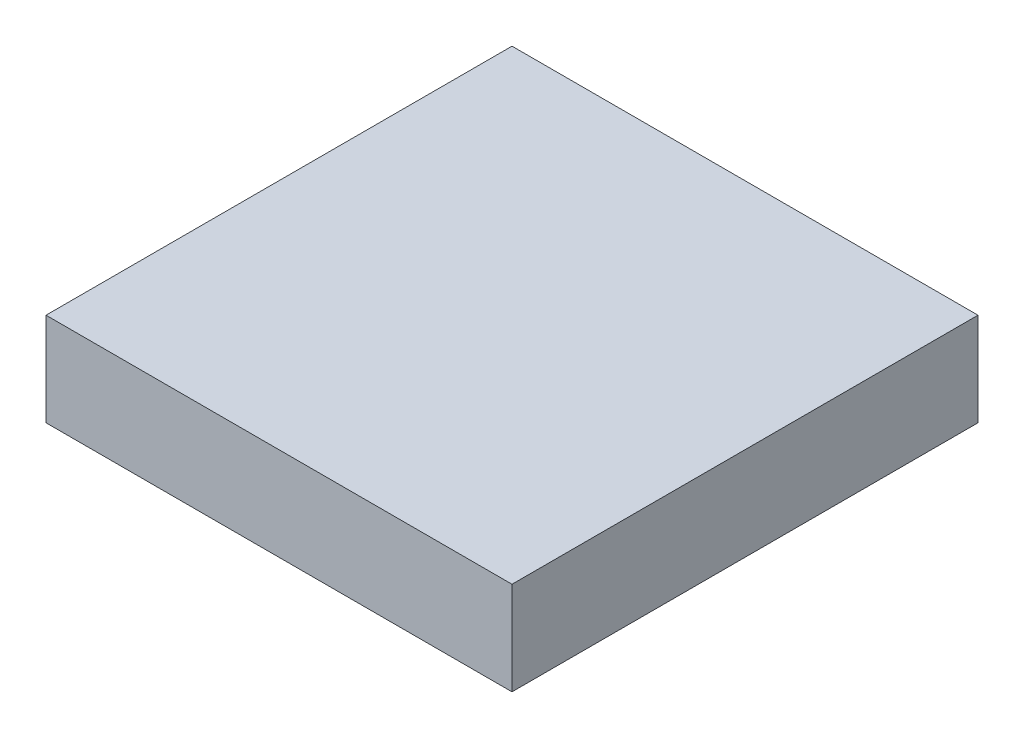
ISO-10303-21;
HEADER;
FILE_DESCRIPTION(('STEP AP214'),'2;1');
FILE_NAME('part.step','',(''),(''),'','','');
FILE_SCHEMA(('AUTOMOTIVE_DESIGN { 1 0 10303 214 1 1 1 1 }'));
ENDSEC;
DATA;
#1=APPLICATION_CONTEXT('core data for automotive mechanical design processes');
#2=APPLICATION_PROTOCOL_DEFINITION('international standard','automotive_design',2000,#1);
#3=PRODUCT_CONTEXT('',#1,'mechanical');
#4=PRODUCT('Part','Part','',(#3));
#5=PRODUCT_RELATED_PRODUCT_CATEGORY('part','',(#4));
#6=PRODUCT_DEFINITION_FORMATION('','',#4);
#7=PRODUCT_DEFINITION_CONTEXT('part definition',#1,'design');
#8=PRODUCT_DEFINITION('design','',#6,#7);
#9=PRODUCT_DEFINITION_SHAPE('','',#8);
#10=(LENGTH_UNIT() NAMED_UNIT(*) SI_UNIT(.MILLI.,.METRE.));
#11=(NAMED_UNIT(*) PLANE_ANGLE_UNIT() SI_UNIT($,.RADIAN.));
#12=(NAMED_UNIT(*) SI_UNIT($,.STERADIAN.) SOLID_ANGLE_UNIT());
#13=UNCERTAINTY_MEASURE_WITH_UNIT(LENGTH_MEASURE(1.E-05),#10,'distance_accuracy_value','');
#14=(GEOMETRIC_REPRESENTATION_CONTEXT(3) GLOBAL_UNCERTAINTY_ASSIGNED_CONTEXT((#13)) GLOBAL_UNIT_ASSIGNED_CONTEXT((#10,
#11,#12)) REPRESENTATION_CONTEXT('',''));
#15=CARTESIAN_POINT('',(0.,0.,0.));
#16=DIRECTION('',(0.,0.,1.));
#17=DIRECTION('',(1.,0.,0.));
#18=AXIS2_PLACEMENT_3D('',#15,#16,#17);
#19=CARTESIAN_POINT('',(7.5,3.,7.5));
#20=DIRECTION('',(-1.,0.,0.));
#21=DIRECTION('',(0.,0.,1.));
#22=AXIS2_PLACEMENT_3D('',#19,#20,#21);
#23=PLANE('',#22);
#24=DIRECTION('',(0.,0.,-1.));
#25=VECTOR('',#24,1.);
#26=CARTESIAN_POINT('',(7.5,0.,7.5));
#27=LINE('',#26,#25);
#28=CARTESIAN_POINT('',(7.5,0.,7.5));
#29=VERTEX_POINT('',#28);
#30=CARTESIAN_POINT('',(7.5,0.,-7.5));
#31=VERTEX_POINT('',#30);
#32=EDGE_CURVE('E96',#29,#31,#27,.T.);
#33=ORIENTED_EDGE('',*,*,#32,.T.);
#34=DIRECTION('',(0.,-1.,0.));
#35=VECTOR('',#34,1.);
#36=CARTESIAN_POINT('',(7.5,3.,-7.5));
#37=LINE('',#36,#35);
#38=CARTESIAN_POINT('',(7.5,3.,-7.5));
#39=VERTEX_POINT('',#38);
#40=EDGE_CURVE('E11',#39,#31,#37,.T.);
#41=ORIENTED_EDGE('',*,*,#40,.F.);
#42=DIRECTION('',(0.,0.,-1.));
#43=VECTOR('',#42,1.);
#44=CARTESIAN_POINT('',(7.5,3.,7.5));
#45=LINE('',#44,#43);
#46=CARTESIAN_POINT('',(7.5,3.,7.5));
#47=VERTEX_POINT('',#46);
#48=EDGE_CURVE('E84',#47,#39,#45,.T.);
#49=ORIENTED_EDGE('',*,*,#48,.F.);
#50=DIRECTION('',(0.,-1.,0.));
#51=VECTOR('',#50,1.);
#52=CARTESIAN_POINT('',(7.5,3.,7.5));
#53=LINE('',#52,#51);
#54=EDGE_CURVE('E92',#47,#29,#53,.T.);
#55=ORIENTED_EDGE('',*,*,#54,.T.);
#56=EDGE_LOOP('',(#33,#41,#49,#55));
#57=FACE_BOUND('',#56,.T.);
#58=ADVANCED_FACE('F33',(#57),#23,.F.);
#59=CARTESIAN_POINT('',(-7.5,3.,-7.5));
#60=DIRECTION('',(0.,0.,1.));
#61=DIRECTION('',(1.,0.,0.));
#62=AXIS2_PLACEMENT_3D('',#59,#60,#61);
#63=PLANE('',#62);
#64=DIRECTION('',(-1.,0.,0.));
#65=VECTOR('',#64,1.);
#66=CARTESIAN_POINT('',(-7.5,0.,-7.5));
#67=LINE('',#66,#65);
#68=CARTESIAN_POINT('',(-7.5,0.,-7.5));
#69=VERTEX_POINT('',#68);
#70=EDGE_CURVE('E88',#31,#69,#67,.T.);
#71=ORIENTED_EDGE('',*,*,#70,.T.);
#72=DIRECTION('',(0.,-1.,0.));
#73=VECTOR('',#72,1.);
#74=CARTESIAN_POINT('',(-7.5,3.,-7.5));
#75=LINE('',#74,#73);
#76=CARTESIAN_POINT('',(-7.5,3.,-7.5));
#77=VERTEX_POINT('',#76);
#78=EDGE_CURVE('E41',#77,#69,#75,.T.);
#79=ORIENTED_EDGE('',*,*,#78,.F.);
#80=DIRECTION('',(-1.,0.,0.));
#81=VECTOR('',#80,1.);
#82=CARTESIAN_POINT('',(-7.5,3.,-7.5));
#83=LINE('',#82,#81);
#84=EDGE_CURVE('E79',#39,#77,#83,.T.);
#85=ORIENTED_EDGE('',*,*,#84,.F.);
#86=ORIENTED_EDGE('',*,*,#40,.T.);
#87=EDGE_LOOP('',(#71,#79,#85,#86));
#88=FACE_BOUND('',#87,.T.);
#89=ADVANCED_FACE('F87',(#88),#63,.F.);
#90=CARTESIAN_POINT('',(-7.5,3.,7.5));
#91=DIRECTION('',(1.,0.,0.));
#92=DIRECTION('',(0.,0.,-1.));
#93=AXIS2_PLACEMENT_3D('',#90,#91,#92);
#94=PLANE('',#93);
#95=DIRECTION('',(0.,0.,1.));
#96=VECTOR('',#95,1.);
#97=CARTESIAN_POINT('',(-7.5,0.,7.5));
#98=LINE('',#97,#96);
#99=CARTESIAN_POINT('',(-7.5,0.,7.5));
#100=VERTEX_POINT('',#99);
#101=EDGE_CURVE('E66',#69,#100,#98,.T.);
#102=ORIENTED_EDGE('',*,*,#101,.T.);
#103=DIRECTION('',(0.,-1.,0.));
#104=VECTOR('',#103,1.);
#105=CARTESIAN_POINT('',(-7.5,3.,7.5));
#106=LINE('',#105,#104);
#107=CARTESIAN_POINT('',(-7.5,3.,7.5));
#108=VERTEX_POINT('',#107);
#109=EDGE_CURVE('E89',#108,#100,#106,.T.);
#110=ORIENTED_EDGE('',*,*,#109,.F.);
#111=DIRECTION('',(0.,0.,1.));
#112=VECTOR('',#111,1.);
#113=CARTESIAN_POINT('',(-7.5,3.,7.5));
#114=LINE('',#113,#112);
#115=EDGE_CURVE('E82',#77,#108,#114,.T.);
#116=ORIENTED_EDGE('',*,*,#115,.F.);
#117=ORIENTED_EDGE('',*,*,#78,.T.);
#118=EDGE_LOOP('',(#102,#110,#116,#117));
#119=FACE_BOUND('',#118,.T.);
#120=ADVANCED_FACE('F90',(#119),#94,.F.);
#121=CARTESIAN_POINT('',(-7.5,3.,7.5));
#122=DIRECTION('',(0.,0.,-1.));
#123=DIRECTION('',(-1.,0.,0.));
#124=AXIS2_PLACEMENT_3D('',#121,#122,#123);
#125=PLANE('',#124);
#126=DIRECTION('',(1.,0.,0.));
#127=VECTOR('',#126,1.);
#128=CARTESIAN_POINT('',(-7.5,0.,7.5));
#129=LINE('',#128,#127);
#130=EDGE_CURVE('E72',#100,#29,#129,.T.);
#131=ORIENTED_EDGE('',*,*,#130,.T.);
#132=ORIENTED_EDGE('',*,*,#54,.F.);
#133=DIRECTION('',(1.,0.,0.));
#134=VECTOR('',#133,1.);
#135=CARTESIAN_POINT('',(-7.5,3.,7.5));
#136=LINE('',#135,#134);
#137=EDGE_CURVE('E49',#108,#47,#136,.T.);
#138=ORIENTED_EDGE('',*,*,#137,.F.);
#139=ORIENTED_EDGE('',*,*,#109,.T.);
#140=EDGE_LOOP('',(#131,#132,#138,#139));
#141=FACE_BOUND('',#140,.T.);
#142=ADVANCED_FACE('F104',(#141),#125,.F.);
#143=CARTESIAN_POINT('',(0.,3.,0.));
#144=DIRECTION('',(0.,-1.,0.));
#145=DIRECTION('',(0.,0.,-1.));
#146=AXIS2_PLACEMENT_3D('',#143,#144,#145);
#147=PLANE('',#146);
#148=ORIENTED_EDGE('',*,*,#48,.T.);
#149=ORIENTED_EDGE('',*,*,#84,.T.);
#150=ORIENTED_EDGE('',*,*,#115,.T.);
#151=ORIENTED_EDGE('',*,*,#137,.T.);
#152=EDGE_LOOP('',(#148,#149,#150,#151));
#153=FACE_BOUND('',#152,.T.);
#154=ADVANCED_FACE('F80',(#153),#147,.F.);
#155=CARTESIAN_POINT('',(0.,0.,0.));
#156=DIRECTION('',(0.,-1.,0.));
#157=DIRECTION('',(0.,0.,-1.));
#158=AXIS2_PLACEMENT_3D('',#155,#156,#157);
#159=PLANE('',#158);
#160=CARTESIAN_POINT('',(5.5,0.,-5.5));
#161=DIRECTION('',(0.,-1.,0.));
#162=DIRECTION('',(0.,0.,-1.));
#163=AXIS2_PLACEMENT_3D('',#160,#161,#162);
#164=CIRCLE('',#163,1.25);
#165=CARTESIAN_POINT('',(5.5,0.,-6.75));
#166=VERTEX_POINT('',#165);
#167=EDGE_CURVE('E128',#166,#166,#164,.T.);
#168=ORIENTED_EDGE('',*,*,#167,.F.);
#169=EDGE_LOOP('',(#168));
#170=FACE_BOUND('',#169,.T.);
#171=CARTESIAN_POINT('',(-5.5,0.,-5.5));
#172=DIRECTION('',(0.,-1.,0.));
#173=DIRECTION('',(0.,0.,-1.));
#174=AXIS2_PLACEMENT_3D('',#171,#172,#173);
#175=CIRCLE('',#174,1.25);
#176=CARTESIAN_POINT('',(-5.5,0.,-6.75));
#177=VERTEX_POINT('',#176);
#178=EDGE_CURVE('E134',#177,#177,#175,.T.);
#179=ORIENTED_EDGE('',*,*,#178,.F.);
#180=EDGE_LOOP('',(#179));
#181=FACE_BOUND('',#180,.T.);
#182=CARTESIAN_POINT('',(-5.5,0.,5.5));
#183=DIRECTION('',(0.,-1.,0.));
#184=DIRECTION('',(0.,0.,-1.));
#185=AXIS2_PLACEMENT_3D('',#182,#183,#184);
#186=CIRCLE('',#185,1.25);
#187=CARTESIAN_POINT('',(-5.5,0.,4.25));
#188=VERTEX_POINT('',#187);
#189=EDGE_CURVE('E140',#188,#188,#186,.T.);
#190=ORIENTED_EDGE('',*,*,#189,.F.);
#191=EDGE_LOOP('',(#190));
#192=FACE_BOUND('',#191,.T.);
#193=CARTESIAN_POINT('',(5.5,0.,5.5));
#194=DIRECTION('',(0.,-1.,0.));
#195=DIRECTION('',(0.,0.,-1.));
#196=AXIS2_PLACEMENT_3D('',#193,#194,#195);
#197=CIRCLE('',#196,1.25);
#198=CARTESIAN_POINT('',(5.5,0.,4.25));
#199=VERTEX_POINT('',#198);
#200=EDGE_CURVE('E122',#199,#199,#197,.T.);
#201=ORIENTED_EDGE('',*,*,#200,.F.);
#202=EDGE_LOOP('',(#201));
#203=FACE_BOUND('',#202,.T.);
#204=CARTESIAN_POINT('',(0.,0.,0.));
#205=DIRECTION('',(0.,-1.,0.));
#206=DIRECTION('',(0.,0.,-1.));
#207=AXIS2_PLACEMENT_3D('',#204,#205,#206);
#208=CIRCLE('',#207,6.);
#209=CARTESIAN_POINT('',(0.,0.,-6.));
#210=VERTEX_POINT('',#209);
#211=EDGE_CURVE('E110',#210,#210,#208,.T.);
#212=ORIENTED_EDGE('',*,*,#211,.F.);
#213=EDGE_LOOP('',(#212));
#214=FACE_BOUND('',#213,.T.);
#215=ORIENTED_EDGE('',*,*,#32,.F.);
#216=ORIENTED_EDGE('',*,*,#130,.F.);
#217=ORIENTED_EDGE('',*,*,#101,.F.);
#218=ORIENTED_EDGE('',*,*,#70,.F.);
#219=EDGE_LOOP('',(#215,#216,#217,#218));
#220=FACE_BOUND('',#219,.T.);
#221=ADVANCED_FACE('F107',(#170,#181,#192,#203,#214,#220),#159,.T.);
#222=CARTESIAN_POINT('',(0.,2.,0.));
#223=DIRECTION('',(0.,-1.,0.));
#224=DIRECTION('',(0.,0.,-1.));
#225=AXIS2_PLACEMENT_3D('',#222,#223,#224);
#226=CYLINDRICAL_SURFACE('',#225,6.);
#227=CARTESIAN_POINT('',(0.,2.,0.));
#228=DIRECTION('',(0.,-1.,0.));
#229=DIRECTION('',(0.,0.,-1.));
#230=AXIS2_PLACEMENT_3D('',#227,#228,#229);
#231=CIRCLE('',#230,6.);
#232=CARTESIAN_POINT('',(0.,2.,-6.));
#233=VERTEX_POINT('',#232);
#234=EDGE_CURVE('E99',#233,#233,#231,.T.);
#235=ORIENTED_EDGE('',*,*,#234,.F.);
#236=EDGE_LOOP('',(#235));
#237=FACE_BOUND('',#236,.T.);
#238=ORIENTED_EDGE('',*,*,#211,.T.);
#239=EDGE_LOOP('',(#238));
#240=FACE_BOUND('',#239,.T.);
#241=ADVANCED_FACE('F157',(#237,#240),#226,.F.);
#242=CARTESIAN_POINT('',(0.,2.,0.));
#243=DIRECTION('',(0.,-1.,0.));
#244=DIRECTION('',(0.,0.,-1.));
#245=AXIS2_PLACEMENT_3D('',#242,#243,#244);
#246=PLANE('',#245);
#247=CARTESIAN_POINT('',(0.,2.,0.));
#248=DIRECTION('',(0.,-1.,0.));
#249=DIRECTION('',(0.,0.,-1.));
#250=AXIS2_PLACEMENT_3D('',#247,#248,#249);
#251=CIRCLE('',#250,2.5);
#252=CARTESIAN_POINT('',(0.,2.,-2.5));
#253=VERTEX_POINT('',#252);
#254=EDGE_CURVE('E113',#253,#253,#251,.T.);
#255=ORIENTED_EDGE('',*,*,#254,.F.);
#256=EDGE_LOOP('',(#255));
#257=FACE_BOUND('',#256,.T.);
#258=ORIENTED_EDGE('',*,*,#234,.T.);
#259=EDGE_LOOP('',(#258));
#260=FACE_BOUND('',#259,.T.);
#261=ADVANCED_FACE('F166',(#257,#260),#246,.T.);
#262=CARTESIAN_POINT('',(0.,2.,0.));
#263=DIRECTION('',(0.,-1.,0.));
#264=DIRECTION('',(0.,0.,-1.));
#265=AXIS2_PLACEMENT_3D('',#262,#263,#264);
#266=CYLINDRICAL_SURFACE('',#265,2.5);
#267=ORIENTED_EDGE('',*,*,#254,.T.);
#268=EDGE_LOOP('',(#267));
#269=FACE_BOUND('',#268,.T.);
#270=CARTESIAN_POINT('',(0.,0.,0.));
#271=DIRECTION('',(0.,-1.,0.));
#272=DIRECTION('',(0.,0.,-1.));
#273=AXIS2_PLACEMENT_3D('',#270,#271,#272);
#274=CIRCLE('',#273,2.5);
#275=CARTESIAN_POINT('',(0.,0.,-2.5));
#276=VERTEX_POINT('',#275);
#277=EDGE_CURVE('E116',#276,#276,#274,.T.);
#278=ORIENTED_EDGE('',*,*,#277,.F.);
#279=EDGE_LOOP('',(#278));
#280=FACE_BOUND('',#279,.T.);
#281=ADVANCED_FACE('F172',(#269,#280),#266,.T.);
#282=ORIENTED_EDGE('',*,*,#277,.T.);
#283=EDGE_LOOP('',(#282));
#284=FACE_BOUND('',#283,.T.);
#285=ADVANCED_FACE('F160',(#284),#159,.T.);
#286=CARTESIAN_POINT('',(5.5,2.,5.5));
#287=DIRECTION('',(0.,-1.,0.));
#288=DIRECTION('',(0.,0.,-1.));
#289=AXIS2_PLACEMENT_3D('',#286,#287,#288);
#290=CYLINDRICAL_SURFACE('',#289,1.25);
#291=CARTESIAN_POINT('',(5.5,2.,5.5));
#292=DIRECTION('',(0.,-1.,0.));
#293=DIRECTION('',(0.,0.,-1.));
#294=AXIS2_PLACEMENT_3D('',#291,#292,#293);
#295=CIRCLE('',#294,1.25);
#296=CARTESIAN_POINT('',(5.5,2.,4.25));
#297=VERTEX_POINT('',#296);
#298=EDGE_CURVE('E119',#297,#297,#295,.T.);
#299=ORIENTED_EDGE('',*,*,#298,.F.);
#300=EDGE_LOOP('',(#299));
#301=FACE_BOUND('',#300,.T.);
#302=ORIENTED_EDGE('',*,*,#200,.T.);
#303=EDGE_LOOP('',(#302));
#304=FACE_BOUND('',#303,.T.);
#305=ADVANCED_FACE('F206',(#301,#304),#290,.F.);
#306=CARTESIAN_POINT('',(5.5,2.,5.5));
#307=DIRECTION('',(0.,-1.,0.));
#308=DIRECTION('',(0.,0.,-1.));
#309=AXIS2_PLACEMENT_3D('',#306,#307,#308);
#310=PLANE('',#309);
#311=ORIENTED_EDGE('',*,*,#298,.T.);
#312=EDGE_LOOP('',(#311));
#313=FACE_BOUND('',#312,.T.);
#314=ADVANCED_FACE('F151',(#313),#310,.T.);
#315=CARTESIAN_POINT('',(-5.5,2.,5.5));
#316=DIRECTION('',(0.,-1.,0.));
#317=DIRECTION('',(0.,0.,-1.));
#318=AXIS2_PLACEMENT_3D('',#315,#316,#317);
#319=CYLINDRICAL_SURFACE('',#318,1.25);
#320=CARTESIAN_POINT('',(-5.5,2.,5.5));
#321=DIRECTION('',(0.,-1.,0.));
#322=DIRECTION('',(0.,0.,-1.));
#323=AXIS2_PLACEMENT_3D('',#320,#321,#322);
#324=CIRCLE('',#323,1.25);
#325=CARTESIAN_POINT('',(-5.5,2.,4.25));
#326=VERTEX_POINT('',#325);
#327=EDGE_CURVE('E125',#326,#326,#324,.T.);
#328=ORIENTED_EDGE('',*,*,#327,.F.);
#329=EDGE_LOOP('',(#328));
#330=FACE_BOUND('',#329,.T.);
#331=ORIENTED_EDGE('',*,*,#189,.T.);
#332=EDGE_LOOP('',(#331));
#333=FACE_BOUND('',#332,.T.);
#334=ADVANCED_FACE('F148',(#330,#333),#319,.F.);
#335=CARTESIAN_POINT('',(-5.5,2.,5.5));
#336=DIRECTION('',(0.,-1.,0.));
#337=DIRECTION('',(0.,0.,-1.));
#338=AXIS2_PLACEMENT_3D('',#335,#336,#337);
#339=PLANE('',#338);
#340=ORIENTED_EDGE('',*,*,#327,.T.);
#341=EDGE_LOOP('',(#340));
#342=FACE_BOUND('',#341,.T.);
#343=ADVANCED_FACE('F146',(#342),#339,.T.);
#344=CARTESIAN_POINT('',(-5.5,2.,-5.5));
#345=DIRECTION('',(0.,-1.,0.));
#346=DIRECTION('',(0.,0.,-1.));
#347=AXIS2_PLACEMENT_3D('',#344,#345,#346);
#348=CYLINDRICAL_SURFACE('',#347,1.25);
#349=CARTESIAN_POINT('',(-5.5,2.,-5.5));
#350=DIRECTION('',(0.,-1.,0.));
#351=DIRECTION('',(0.,0.,-1.));
#352=AXIS2_PLACEMENT_3D('',#349,#350,#351);
#353=CIRCLE('',#352,1.25);
#354=CARTESIAN_POINT('',(-5.5,2.,-6.75));
#355=VERTEX_POINT('',#354);
#356=EDGE_CURVE('E137',#355,#355,#353,.T.);
#357=ORIENTED_EDGE('',*,*,#356,.F.);
#358=EDGE_LOOP('',(#357));
#359=FACE_BOUND('',#358,.T.);
#360=ORIENTED_EDGE('',*,*,#178,.T.);
#361=EDGE_LOOP('',(#360));
#362=FACE_BOUND('',#361,.T.);
#363=ADVANCED_FACE('F236',(#359,#362),#348,.F.);
#364=CARTESIAN_POINT('',(-5.5,2.,-5.5));
#365=DIRECTION('',(0.,-1.,0.));
#366=DIRECTION('',(0.,0.,-1.));
#367=AXIS2_PLACEMENT_3D('',#364,#365,#366);
#368=PLANE('',#367);
#369=ORIENTED_EDGE('',*,*,#356,.T.);
#370=EDGE_LOOP('',(#369));
#371=FACE_BOUND('',#370,.T.);
#372=ADVANCED_FACE('F245',(#371),#368,.T.);
#373=CARTESIAN_POINT('',(5.5,2.,-5.5));
#374=DIRECTION('',(0.,-1.,0.));
#375=DIRECTION('',(0.,0.,-1.));
#376=AXIS2_PLACEMENT_3D('',#373,#374,#375);
#377=CYLINDRICAL_SURFACE('',#376,1.25);
#378=CARTESIAN_POINT('',(5.5,2.,-5.5));
#379=DIRECTION('',(0.,-1.,0.));
#380=DIRECTION('',(0.,0.,-1.));
#381=AXIS2_PLACEMENT_3D('',#378,#379,#380);
#382=CIRCLE('',#381,1.25);
#383=CARTESIAN_POINT('',(5.5,2.,-6.75));
#384=VERTEX_POINT('',#383);
#385=EDGE_CURVE('E131',#384,#384,#382,.T.);
#386=ORIENTED_EDGE('',*,*,#385,.F.);
#387=EDGE_LOOP('',(#386));
#388=FACE_BOUND('',#387,.T.);
#389=ORIENTED_EDGE('',*,*,#167,.T.);
#390=EDGE_LOOP('',(#389));
#391=FACE_BOUND('',#390,.T.);
#392=ADVANCED_FACE('F255',(#388,#391),#377,.F.);
#393=CARTESIAN_POINT('',(5.5,2.,-5.5));
#394=DIRECTION('',(0.,-1.,0.));
#395=DIRECTION('',(0.,0.,-1.));
#396=AXIS2_PLACEMENT_3D('',#393,#394,#395);
#397=PLANE('',#396);
#398=ORIENTED_EDGE('',*,*,#385,.T.);
#399=EDGE_LOOP('',(#398));
#400=FACE_BOUND('',#399,.T.);
#401=ADVANCED_FACE('F265',(#400),#397,.T.);
#402=CLOSED_SHELL('',(#58,#89,#120,#142,#154,#221,#241,#261,#281,#285,#305,#314,#334,#343,#363,
#372,#392,#401));
#403=MANIFOLD_SOLID_BREP('B2',#402);
#404=ADVANCED_BREP_SHAPE_REPRESENTATION('',(#18,#403),#14);
#405=SHAPE_DEFINITION_REPRESENTATION(#9,#404);
ENDSEC;
END-ISO-10303-21;
